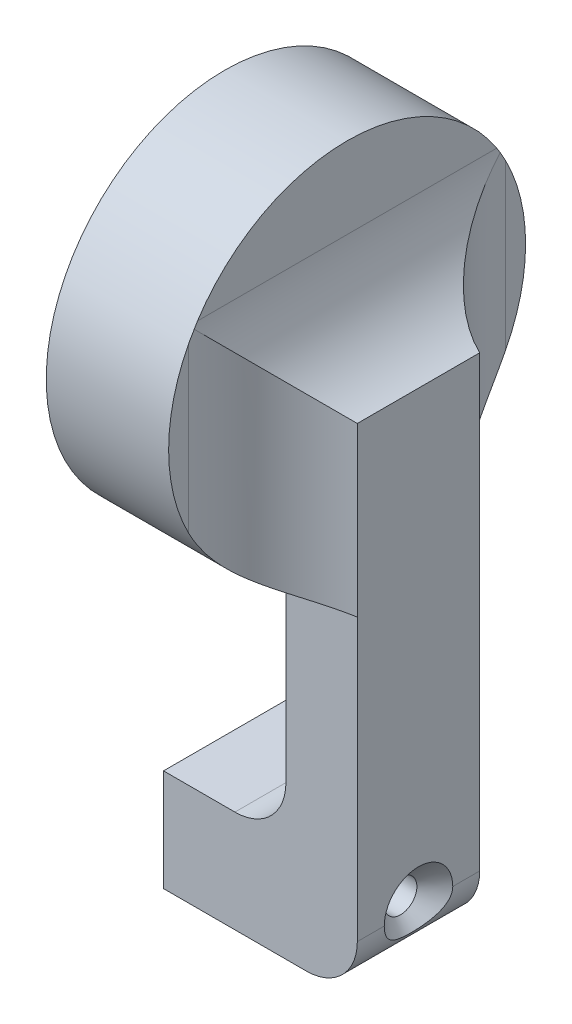
ISO-10303-21;
HEADER;
FILE_DESCRIPTION(('STEP AP214'),'2;1');
FILE_NAME('part.step','',(''),(''),'','','');
FILE_SCHEMA(('AUTOMOTIVE_DESIGN { 1 0 10303 214 1 1 1 1 }'));
ENDSEC;
DATA;
#1=APPLICATION_CONTEXT('core data for automotive mechanical design processes');
#2=APPLICATION_PROTOCOL_DEFINITION('international standard','automotive_design',2000,#1);
#3=PRODUCT_CONTEXT('',#1,'mechanical');
#4=PRODUCT('Part','Part','',(#3));
#5=PRODUCT_RELATED_PRODUCT_CATEGORY('part','',(#4));
#6=PRODUCT_DEFINITION_FORMATION('','',#4);
#7=PRODUCT_DEFINITION_CONTEXT('part definition',#1,'design');
#8=PRODUCT_DEFINITION('design','',#6,#7);
#9=PRODUCT_DEFINITION_SHAPE('','',#8);
#10=(LENGTH_UNIT() NAMED_UNIT(*) SI_UNIT(.MILLI.,.METRE.));
#11=(NAMED_UNIT(*) PLANE_ANGLE_UNIT() SI_UNIT($,.RADIAN.));
#12=(NAMED_UNIT(*) SI_UNIT($,.STERADIAN.) SOLID_ANGLE_UNIT());
#13=UNCERTAINTY_MEASURE_WITH_UNIT(LENGTH_MEASURE(1.E-05),#10,'distance_accuracy_value','');
#14=(GEOMETRIC_REPRESENTATION_CONTEXT(3) GLOBAL_UNCERTAINTY_ASSIGNED_CONTEXT((#13)) GLOBAL_UNIT_ASSIGNED_CONTEXT((#10,
#11,#12)) REPRESENTATION_CONTEXT('',''));
#15=CARTESIAN_POINT('',(0.,0.,0.));
#16=DIRECTION('',(0.,0.,1.));
#17=DIRECTION('',(1.,0.,0.));
#18=AXIS2_PLACEMENT_3D('',#15,#16,#17);
#19=CARTESIAN_POINT('',(-7.00000000000001,49.,6.));
#20=DIRECTION('',(-1.,0.,0.));
#21=DIRECTION('',(0.,-1.,0.));
#22=AXIS2_PLACEMENT_3D('',#19,#20,#21);
#23=PLANE('',#22);
#24=CARTESIAN_POINT('',(-7.00000000000001,49.,6.));
#25=DIRECTION('',(1.,0.,0.));
#26=DIRECTION('',(0.,1.,0.));
#27=AXIS2_PLACEMENT_3D('',#24,#25,#26);
#28=CIRCLE('',#27,17.5);
#29=CARTESIAN_POINT('',(-7.00000000000001,40.9515656286476,-9.53939201416945));
#30=VERTEX_POINT('',#29);
#31=CARTESIAN_POINT('',(-7.00000000000001,57.0484343713524,-9.53939201416945));
#32=VERTEX_POINT('',#31);
#33=EDGE_CURVE('E383',#30,#32,#28,.T.);
#34=ORIENTED_EDGE('',*,*,#33,.T.);
#35=DIRECTION('',(0.,-1.,0.));
#36=VECTOR('',#35,1.);
#37=CARTESIAN_POINT('',(-7.00000000000001,49.,-9.53939201416945));
#38=LINE('',#37,#36);
#39=EDGE_CURVE('E267',#32,#30,#38,.T.);
#40=ORIENTED_EDGE('',*,*,#39,.T.);
#41=EDGE_LOOP('',(#34,#40));
#42=FACE_BOUND('',#41,.T.);
#43=ADVANCED_FACE('F37',(#42),#23,.F.);
#44=CARTESIAN_POINT('',(-7.00000000000001,58.5393920141695,-8.67140075112121));
#45=VERTEX_POINT('',#44);
#46=CARTESIAN_POINT('',(-7.00000000000001,58.5393920141695,20.6714007511212));
#47=VERTEX_POINT('',#46);
#48=EDGE_CURVE('E259',#45,#47,#28,.T.);
#49=ORIENTED_EDGE('',*,*,#48,.T.);
#50=DIRECTION('',(0.,0.,-1.));
#51=VECTOR('',#50,1.);
#52=CARTESIAN_POINT('',(-7.00000000000001,58.5393920141695,6.));
#53=LINE('',#52,#51);
#54=EDGE_CURVE('E265',#47,#45,#53,.T.);
#55=ORIENTED_EDGE('',*,*,#54,.T.);
#56=EDGE_LOOP('',(#49,#55));
#57=FACE_BOUND('',#56,.T.);
#58=ADVANCED_FACE('F228',(#57),#23,.F.);
#59=CARTESIAN_POINT('',(-19.,10.,12.));
#60=DIRECTION('',(1.,0.,0.));
#61=DIRECTION('',(0.,0.,-1.));
#62=AXIS2_PLACEMENT_3D('',#59,#60,#61);
#63=PLANE('',#62);
#64=CARTESIAN_POINT('',(-19.,5.,6.));
#65=DIRECTION('',(1.,0.,0.));
#66=DIRECTION('',(0.,0.,-1.));
#67=AXIS2_PLACEMENT_3D('',#64,#65,#66);
#68=CIRCLE('',#67,1.6);
#69=CARTESIAN_POINT('',(-19.,5.,4.4));
#70=VERTEX_POINT('',#69);
#71=EDGE_CURVE('E187',#70,#70,#68,.T.);
#72=ORIENTED_EDGE('',*,*,#71,.T.);
#73=EDGE_LOOP('',(#72));
#74=FACE_BOUND('',#73,.T.);
#75=DIRECTION('',(0.,-1.,0.));
#76=VECTOR('',#75,1.);
#77=CARTESIAN_POINT('',(-19.,10.,0.));
#78=LINE('',#77,#76);
#79=CARTESIAN_POINT('',(-19.,10.,0.));
#80=VERTEX_POINT('',#79);
#81=CARTESIAN_POINT('',(-19.,0.,0.));
#82=VERTEX_POINT('',#81);
#83=EDGE_CURVE('E347',#80,#82,#78,.T.);
#84=ORIENTED_EDGE('',*,*,#83,.T.);
#85=DIRECTION('',(0.,0.,-1.));
#86=VECTOR('',#85,1.);
#87=CARTESIAN_POINT('',(-19.,0.,12.));
#88=LINE('',#87,#86);
#89=CARTESIAN_POINT('',(-19.,0.,12.));
#90=VERTEX_POINT('',#89);
#91=EDGE_CURVE('E363',#90,#82,#88,.T.);
#92=ORIENTED_EDGE('',*,*,#91,.F.);
#93=DIRECTION('',(0.,-1.,0.));
#94=VECTOR('',#93,1.);
#95=CARTESIAN_POINT('',(-19.,10.,12.));
#96=LINE('',#95,#94);
#97=CARTESIAN_POINT('',(-19.,10.,12.));
#98=VERTEX_POINT('',#97);
#99=EDGE_CURVE('E339',#98,#90,#96,.T.);
#100=ORIENTED_EDGE('',*,*,#99,.F.);
#101=DIRECTION('',(0.,0.,-1.));
#102=VECTOR('',#101,1.);
#103=CARTESIAN_POINT('',(-19.,10.,12.));
#104=LINE('',#103,#102);
#105=EDGE_CURVE('E346',#98,#80,#104,.T.);
#106=ORIENTED_EDGE('',*,*,#105,.T.);
#107=EDGE_LOOP('',(#84,#92,#100,#106));
#108=FACE_BOUND('',#107,.T.);
#109=ADVANCED_FACE('F225',(#74,#108),#63,.F.);
#110=CARTESIAN_POINT('',(-19.,0.,12.));
#111=DIRECTION('',(0.,1.,0.));
#112=DIRECTION('',(0.,0.,1.));
#113=AXIS2_PLACEMENT_3D('',#110,#111,#112);
#114=PLANE('',#113);
#115=DIRECTION('',(1.,0.,0.));
#116=VECTOR('',#115,1.);
#117=CARTESIAN_POINT('',(-19.,0.,0.));
#118=LINE('',#117,#116);
#119=CARTESIAN_POINT('',(-5.,0.,0.));
#120=VERTEX_POINT('',#119);
#121=EDGE_CURVE('E350',#82,#120,#118,.T.);
#122=ORIENTED_EDGE('',*,*,#121,.T.);
#123=DIRECTION('',(0.,0.,-1.));
#124=VECTOR('',#123,1.);
#125=CARTESIAN_POINT('',(-5.,0.,12.));
#126=LINE('',#125,#124);
#127=CARTESIAN_POINT('',(-5.,0.,12.));
#128=VERTEX_POINT('',#127);
#129=EDGE_CURVE('E173',#120,#128,#126,.F.);
#130=ORIENTED_EDGE('',*,*,#129,.T.);
#131=DIRECTION('',(1.,0.,0.));
#132=VECTOR('',#131,1.);
#133=CARTESIAN_POINT('',(-19.,0.,12.));
#134=LINE('',#133,#132);
#135=EDGE_CURVE('E335',#90,#128,#134,.T.);
#136=ORIENTED_EDGE('',*,*,#135,.F.);
#137=ORIENTED_EDGE('',*,*,#91,.T.);
#138=EDGE_LOOP('',(#122,#130,#136,#137));
#139=FACE_BOUND('',#138,.T.);
#140=ADVANCED_FACE('F222',(#139),#114,.F.);
#141=CARTESIAN_POINT('',(0.,0.,12.));
#142=DIRECTION('',(-1.,0.,0.));
#143=DIRECTION('',(0.,0.,1.));
#144=AXIS2_PLACEMENT_3D('',#141,#142,#143);
#145=PLANE('',#144);
#146=DIRECTION('',(0.,0.,-1.));
#147=VECTOR('',#146,1.);
#148=CARTESIAN_POINT('',(0.,5.,12.));
#149=LINE('',#148,#147);
#150=CARTESIAN_POINT('',(0.,5.,12.));
#151=VERTEX_POINT('',#150);
#152=CARTESIAN_POINT('',(0.,5.,9.36));
#153=VERTEX_POINT('',#152);
#154=EDGE_CURVE('E157',#151,#153,#149,.T.);
#155=ORIENTED_EDGE('',*,*,#154,.T.);
#156=CARTESIAN_POINT('',(0.,5.,6.));
#157=DIRECTION('',(1.,0.,0.));
#158=DIRECTION('',(0.,0.,-1.));
#159=AXIS2_PLACEMENT_3D('',#156,#157,#158);
#160=CIRCLE('',#159,3.36);
#161=CARTESIAN_POINT('',(0.,5.,2.64));
#162=VERTEX_POINT('',#161);
#163=EDGE_CURVE('E143',#162,#153,#160,.T.);
#164=ORIENTED_EDGE('',*,*,#163,.F.);
#165=CARTESIAN_POINT('',(0.,5.,0.));
#166=VERTEX_POINT('',#165);
#167=EDGE_CURVE('E154',#162,#166,#149,.T.);
#168=ORIENTED_EDGE('',*,*,#167,.T.);
#169=DIRECTION('',(0.,1.,0.));
#170=VECTOR('',#169,1.);
#171=CARTESIAN_POINT('',(0.,0.,0.));
#172=LINE('',#171,#170);
#173=CARTESIAN_POINT('',(0.,32.5607177772264,0.));
#174=VERTEX_POINT('',#173);
#175=EDGE_CURVE('E354',#166,#174,#172,.T.);
#176=ORIENTED_EDGE('',*,*,#175,.T.);
#177=CARTESIAN_POINT('',(0.,49.,0.));
#178=VERTEX_POINT('',#177);
#179=EDGE_CURVE('E353',#174,#178,#172,.T.);
#180=ORIENTED_EDGE('',*,*,#179,.T.);
#181=DIRECTION('',(0.,0.,-1.));
#182=VECTOR('',#181,1.);
#183=CARTESIAN_POINT('',(0.,49.,12.));
#184=LINE('',#183,#182);
#185=CARTESIAN_POINT('',(0.,49.,12.));
#186=VERTEX_POINT('',#185);
#187=EDGE_CURVE('E329',#186,#178,#184,.T.);
#188=ORIENTED_EDGE('',*,*,#187,.F.);
#189=DIRECTION('',(0.,1.,0.));
#190=VECTOR('',#189,1.);
#191=CARTESIAN_POINT('',(0.,0.,12.));
#192=LINE('',#191,#190);
#193=CARTESIAN_POINT('',(0.,32.5607177772264,12.));
#194=VERTEX_POINT('',#193);
#195=EDGE_CURVE('E332',#194,#186,#192,.T.);
#196=ORIENTED_EDGE('',*,*,#195,.F.);
#197=EDGE_CURVE('E334',#151,#194,#192,.T.);
#198=ORIENTED_EDGE('',*,*,#197,.F.);
#199=EDGE_LOOP('',(#155,#164,#168,#176,#180,#188,#196,#198));
#200=FACE_BOUND('',#199,.T.);
#201=ADVANCED_FACE('F152',(#200),#145,.F.);
#202=CARTESIAN_POINT('',(-7.,49.,12.));
#203=DIRECTION('',(1.,0.,0.));
#204=DIRECTION('',(0.,1.,0.));
#205=AXIS2_PLACEMENT_3D('',#202,#203,#204);
#206=PLANE('',#205);
#207=DIRECTION('',(0.,-1.,0.));
#208=VECTOR('',#207,1.);
#209=CARTESIAN_POINT('',(-7.,49.,12.));
#210=LINE('',#209,#208);
#211=CARTESIAN_POINT('',(-7.,32.5607177772264,12.));
#212=VERTEX_POINT('',#211);
#213=CARTESIAN_POINT('',(-7.,15.,12.));
#214=VERTEX_POINT('',#213);
#215=EDGE_CURVE('E337',#212,#214,#210,.T.);
#216=ORIENTED_EDGE('',*,*,#215,.F.);
#217=CARTESIAN_POINT('',(-7.,32.5607177772264,0.));
#218=VERTEX_POINT('',#217);
#219=EDGE_CURVE('E261',#212,#218,#28,.T.);
#220=ORIENTED_EDGE('',*,*,#219,.T.);
#221=DIRECTION('',(0.,-1.,0.));
#222=VECTOR('',#221,1.);
#223=CARTESIAN_POINT('',(-7.,49.,0.));
#224=LINE('',#223,#222);
#225=CARTESIAN_POINT('',(-7.,15.,0.));
#226=VERTEX_POINT('',#225);
#227=EDGE_CURVE('E356',#218,#226,#224,.T.);
#228=ORIENTED_EDGE('',*,*,#227,.T.);
#229=DIRECTION('',(0.,0.,-1.));
#230=VECTOR('',#229,1.);
#231=CARTESIAN_POINT('',(-7.,15.,12.));
#232=LINE('',#231,#230);
#233=EDGE_CURVE('E165',#226,#214,#232,.F.);
#234=ORIENTED_EDGE('',*,*,#233,.T.);
#235=EDGE_LOOP('',(#216,#220,#228,#234));
#236=FACE_BOUND('',#235,.T.);
#237=ADVANCED_FACE('F215',(#236),#206,.F.);
#238=CARTESIAN_POINT('',(-7.,10.,12.));
#239=DIRECTION('',(0.,-1.,0.));
#240=DIRECTION('',(1.,0.,0.));
#241=AXIS2_PLACEMENT_3D('',#238,#239,#240);
#242=PLANE('',#241);
#243=DIRECTION('',(-1.,0.,0.));
#244=VECTOR('',#243,1.);
#245=CARTESIAN_POINT('',(-7.,10.,12.));
#246=LINE('',#245,#244);
#247=CARTESIAN_POINT('',(-12.,10.,12.));
#248=VERTEX_POINT('',#247);
#249=EDGE_CURVE('E344',#248,#98,#246,.T.);
#250=ORIENTED_EDGE('',*,*,#249,.F.);
#251=DIRECTION('',(0.,0.,-1.));
#252=VECTOR('',#251,1.);
#253=CARTESIAN_POINT('',(-12.,10.,0.));
#254=LINE('',#253,#252);
#255=CARTESIAN_POINT('',(-12.,10.,0.));
#256=VERTEX_POINT('',#255);
#257=EDGE_CURVE('E168',#248,#256,#254,.T.);
#258=ORIENTED_EDGE('',*,*,#257,.T.);
#259=DIRECTION('',(-1.,0.,0.));
#260=VECTOR('',#259,1.);
#261=CARTESIAN_POINT('',(-7.,10.,0.));
#262=LINE('',#261,#260);
#263=EDGE_CURVE('E358',#256,#80,#262,.T.);
#264=ORIENTED_EDGE('',*,*,#263,.T.);
#265=ORIENTED_EDGE('',*,*,#105,.F.);
#266=EDGE_LOOP('',(#250,#258,#264,#265));
#267=FACE_BOUND('',#266,.T.);
#268=ADVANCED_FACE('F207',(#267),#242,.F.);
#269=CARTESIAN_POINT('',(0.,0.,12.));
#270=DIRECTION('',(0.,0.,1.));
#271=DIRECTION('',(1.,0.,0.));
#272=AXIS2_PLACEMENT_3D('',#269,#270,#271);
#273=PLANE('',#272);
#274=ORIENTED_EDGE('',*,*,#197,.T.);
#275=DIRECTION('',(1.,0.,0.));
#276=VECTOR('',#275,1.);
#277=CARTESIAN_POINT('',(0.,32.5607177772264,12.));
#278=LINE('',#277,#276);
#279=EDGE_CURVE('E274',#194,#212,#278,.F.);
#280=ORIENTED_EDGE('',*,*,#279,.T.);
#281=ORIENTED_EDGE('',*,*,#215,.T.);
#282=CARTESIAN_POINT('',(-12.,15.,12.));
#283=DIRECTION('',(0.,0.,1.));
#284=DIRECTION('',(1.,0.,0.));
#285=AXIS2_PLACEMENT_3D('',#282,#283,#284);
#286=CIRCLE('',#285,5.);
#287=EDGE_CURVE('E149',#214,#248,#286,.F.);
#288=ORIENTED_EDGE('',*,*,#287,.T.);
#289=ORIENTED_EDGE('',*,*,#249,.T.);
#290=ORIENTED_EDGE('',*,*,#99,.T.);
#291=ORIENTED_EDGE('',*,*,#135,.T.);
#292=CARTESIAN_POINT('',(-5.,5.,12.));
#293=DIRECTION('',(0.,0.,1.));
#294=DIRECTION('',(1.,0.,0.));
#295=AXIS2_PLACEMENT_3D('',#292,#293,#294);
#296=CIRCLE('',#295,5.);
#297=EDGE_CURVE('E175',#128,#151,#296,.T.);
#298=ORIENTED_EDGE('',*,*,#297,.T.);
#299=EDGE_LOOP('',(#274,#280,#281,#288,#289,#290,#291,#298));
#300=FACE_BOUND('',#299,.T.);
#301=ADVANCED_FACE('F203',(#300),#273,.T.);
#302=CARTESIAN_POINT('',(0.,0.,0.));
#303=DIRECTION('',(0.,0.,1.));
#304=DIRECTION('',(1.,0.,0.));
#305=AXIS2_PLACEMENT_3D('',#302,#303,#304);
#306=PLANE('',#305);
#307=ORIENTED_EDGE('',*,*,#227,.F.);
#308=DIRECTION('',(1.,0.,0.));
#309=VECTOR('',#308,1.);
#310=CARTESIAN_POINT('',(-7.,32.5607177772264,0.));
#311=LINE('',#310,#309);
#312=EDGE_CURVE('E55',#218,#174,#311,.T.);
#313=ORIENTED_EDGE('',*,*,#312,.T.);
#314=ORIENTED_EDGE('',*,*,#175,.F.);
#315=CARTESIAN_POINT('',(-5.,5.,0.));
#316=DIRECTION('',(0.,0.,1.));
#317=DIRECTION('',(1.,0.,0.));
#318=AXIS2_PLACEMENT_3D('',#315,#316,#317);
#319=CIRCLE('',#318,5.);
#320=EDGE_CURVE('E163',#166,#120,#319,.F.);
#321=ORIENTED_EDGE('',*,*,#320,.T.);
#322=ORIENTED_EDGE('',*,*,#121,.F.);
#323=ORIENTED_EDGE('',*,*,#83,.F.);
#324=ORIENTED_EDGE('',*,*,#263,.F.);
#325=CARTESIAN_POINT('',(-12.,15.,0.));
#326=DIRECTION('',(0.,0.,1.));
#327=DIRECTION('',(1.,0.,0.));
#328=AXIS2_PLACEMENT_3D('',#325,#326,#327);
#329=CIRCLE('',#328,5.);
#330=EDGE_CURVE('E177',#256,#226,#329,.T.);
#331=ORIENTED_EDGE('',*,*,#330,.T.);
#332=EDGE_LOOP('',(#307,#313,#314,#321,#322,#323,#324,#331));
#333=FACE_BOUND('',#332,.T.);
#334=ADVANCED_FACE('F206',(#333),#306,.F.);
#335=CARTESIAN_POINT('',(-12.,15.,12.));
#336=DIRECTION('',(0.,0.,1.));
#337=DIRECTION('',(1.,0.,0.));
#338=AXIS2_PLACEMENT_3D('',#335,#336,#337);
#339=CYLINDRICAL_SURFACE('',#338,5.);
#340=ORIENTED_EDGE('',*,*,#287,.F.);
#341=ORIENTED_EDGE('',*,*,#233,.F.);
#342=ORIENTED_EDGE('',*,*,#330,.F.);
#343=ORIENTED_EDGE('',*,*,#257,.F.);
#344=EDGE_LOOP('',(#340,#341,#342,#343));
#345=FACE_BOUND('',#344,.T.);
#346=ADVANCED_FACE('F211',(#345),#339,.F.);
#347=CARTESIAN_POINT('',(-5.,5.,12.));
#348=DIRECTION('',(0.,0.,-1.));
#349=DIRECTION('',(-1.,0.,0.));
#350=AXIS2_PLACEMENT_3D('',#347,#348,#349);
#351=CYLINDRICAL_SURFACE('',#350,5.);
#352=CARTESIAN_POINT('',(-0.011315848843505,5.3362,9.33176456314168));
#353=CARTESIAN_POINT('',(-0.00772757197950208,5.28307357224377,9.34073793852819));
#354=CARTESIAN_POINT('',(-0.00497945405434525,5.22953055867211,9.34759581175659));
#355=CARTESIAN_POINT('',(-0.00120169916334553,5.122015830721,9.35701294987783));
#356=CARTESIAN_POINT('',(-0.000171820449825417,5.06804417772279,9.35957281947863));
#357=CARTESIAN_POINT('',(0.000131472118228314,4.96036392501733,9.36032679135367));
#358=CARTESIAN_POINT('',(-0.000585306709140587,4.90665554543051,9.35854527012781));
#359=CARTESIAN_POINT('',(-0.00372939991401288,4.79961751433382,9.35071351486351));
#360=CARTESIAN_POINT('',(-0.00615666238439298,4.74628785138086,9.34466341036146));
#361=CARTESIAN_POINT('',(-0.0159253410549199,4.58744457367903,9.32024576365697));
#362=CARTESIAN_POINT('',(-0.0257535311398971,4.48297705955291,9.29561130648337));
#363=CARTESIAN_POINT('',(-0.0511079706715936,4.27955678578426,9.23125369367454));
#364=CARTESIAN_POINT('',(-0.0666408958163581,4.18061064416671,9.19151285859589));
#365=CARTESIAN_POINT('',(-0.10780065594994,3.95945787533021,9.08432067602215));
#366=CARTESIAN_POINT('',(-0.135066696296569,3.83987810638988,9.01207505041966));
#367=CARTESIAN_POINT('',(-0.194300629034804,3.61476062083223,8.84977809487663));
#368=CARTESIAN_POINT('',(-0.226278430223792,3.50925341201944,8.7596890995677));
#369=CARTESIAN_POINT('',(-0.302786340538611,3.28099515719922,8.53436772060684));
#370=CARTESIAN_POINT('',(-0.348043164870143,3.16362811449879,8.39393921956447));
#371=CARTESIAN_POINT('',(-0.436543082911837,2.95357013831708,8.09526862430747));
#372=CARTESIAN_POINT('',(-0.479784483712907,2.8608996517784,7.93701192290447));
#373=CARTESIAN_POINT('',(-0.560374395006792,2.69823900641181,7.60408338436946));
#374=CARTESIAN_POINT('',(-0.597599410954371,2.62869902347434,7.42916248661043));
#375=CARTESIAN_POINT('',(-0.660869935185352,2.51479587643307,7.06937216142148));
#376=CARTESIAN_POINT('',(-0.686920351739286,2.47042165589175,6.8845071420317));
#377=CARTESIAN_POINT('',(-0.71611583804456,2.42149152182494,6.59357275552867));
#378=CARTESIAN_POINT('',(-0.724293486961251,2.40800308672433,6.48941630585531));
#379=CARTESIAN_POINT('',(-0.735962021235243,2.38884748067089,6.28009529195409));
#380=CARTESIAN_POINT('',(-0.739452635648961,2.38318076186779,6.17493066980064));
#381=CARTESIAN_POINT('',(-0.741585846386518,2.37971176779502,5.96443622077509));
#382=CARTESIAN_POINT('',(-0.740228832692547,2.38190885989719,5.85910640787367));
#383=CARTESIAN_POINT('',(-0.732729668104386,2.39414978583919,5.64907937764492));
#384=CARTESIAN_POINT('',(-0.726587665424963,2.40419337663419,5.54438214082481));
#385=CARTESIAN_POINT('',(-0.71006240462118,2.43159920249629,5.33992933377131));
#386=CARTESIAN_POINT('',(-0.699830224721958,2.44870137904128,5.24012667212315));
#387=CARTESIAN_POINT('',(-0.67553629625392,2.4901033720404,5.0424887789204));
#388=CARTESIAN_POINT('',(-0.661473112784251,2.5144058856773,4.94465429932124));
#389=CARTESIAN_POINT('',(-0.614236269318479,2.59807498640754,4.6548734095481));
#390=CARTESIAN_POINT('',(-0.576020476960907,2.66819538143867,4.46670765982541));
#391=CARTESIAN_POINT('',(-0.489785843920782,2.83956766751821,4.09966973084193));
#392=CARTESIAN_POINT('',(-0.441483987169242,2.94177466091574,3.92131253643957));
#393=CARTESIAN_POINT('',(-0.342385466911368,3.17712524663109,3.58706097826518));
#394=CARTESIAN_POINT('',(-0.291594189785173,3.31020418581873,3.43112075846701));
#395=CARTESIAN_POINT('',(-0.212414903947883,3.55462385826613,3.20098665563638));
#396=CARTESIAN_POINT('',(-0.182506143715357,3.65674365246584,3.11749212386189));
#397=CARTESIAN_POINT('',(-0.127245129021495,3.87362483269717,2.96708657749484));
#398=CARTESIAN_POINT('',(-0.101884608722848,3.9883626618612,2.90014539367764));
#399=CARTESIAN_POINT('',(-0.0618979768052235,4.20907398221075,2.79626681787713));
#400=CARTESIAN_POINT('',(-0.0461911309715353,4.31336988931187,2.75620128418162));
#401=CARTESIAN_POINT('',(-0.0211960536863761,4.52766386730952,2.69291674577603));
#402=CARTESIAN_POINT('',(-0.0119003541714226,4.63765514273693,2.66967813853637));
#403=CARTESIAN_POINT('',(-0.00141620867842192,4.84625007948362,2.64351010935896));
#404=CARTESIAN_POINT('',(0.00065047606829209,4.94453009213531,2.63837987702755));
#405=CARTESIAN_POINT('',(-0.000598833898096579,5.09179752313453,2.6414908287441));
#406=CARTESIAN_POINT('',(-0.00174785726576853,5.14097425465424,2.64434799236461));
#407=CARTESIAN_POINT('',(-0.00547161679626646,5.23894331790461,2.65363104170702));
#408=CARTESIAN_POINT('',(-0.0080465636192309,5.28773559175654,2.66005745473573));
#409=CARTESIAN_POINT('',(-0.0113158488435046,5.3362,2.66823543685832));
#410=B_SPLINE_CURVE_WITH_KNOTS('',3,(#352,#353,#354,#355,#356,#357,#358,#359,#360,#361,#362,
#363,#364,#365,#366,#367,#368,#369,#370,#371,#372,#373,#374,#375,#376,#377,#378,#379,#380,#381,
#382,#383,#384,#385,#386,#387,#388,#389,#390,#391,#392,#393,#394,#395,#396,#397,#398,#399,#400,
#401,#402,#403,#404,#405,#406,#407,#408,#409),.UNSPECIFIED.,.F.,.F.,(4,2,2,2,2,2,2,2,2,2,2,2,2,
2,2,2,2,2,2,2,2,2,2,2,2,2,2,2,4),(0.,0.161949153878159,0.323875520396958,0.484894782646261,
0.645909158741388,0.967642960373945,1.28975446174662,1.71444230487352,2.14003635901215,
2.70264743268856,3.26572287019871,3.8391909020768,4.41240678839821,4.72809639262478,
5.04380424514692,5.35948670016251,5.67515937732044,5.98011440360915,6.28518380810048,
6.89549708316569,7.52604570336867,8.15528554065106,8.55970909363579,8.96339004202785,
9.30046415482828,9.63714495857486,9.93115234719074,10.0788375168095,10.2265445106583),.UNSPECIFIED.);
#411=EDGE_CURVE('E139',#153,#162,#410,.T.);
#412=ORIENTED_EDGE('',*,*,#411,.F.);
#413=ORIENTED_EDGE('',*,*,#154,.F.);
#414=ORIENTED_EDGE('',*,*,#297,.F.);
#415=ORIENTED_EDGE('',*,*,#129,.F.);
#416=ORIENTED_EDGE('',*,*,#320,.F.);
#417=ORIENTED_EDGE('',*,*,#167,.F.);
#418=EDGE_LOOP('',(#412,#413,#414,#415,#416,#417));
#419=FACE_BOUND('',#418,.T.);
#420=ADVANCED_FACE('F161',(#419),#351,.T.);
#421=CARTESIAN_POINT('',(0.,5.,6.));
#422=DIRECTION('',(1.,0.,0.));
#423=DIRECTION('',(0.,0.,-1.));
#424=AXIS2_PLACEMENT_3D('',#421,#422,#423);
#425=CYLINDRICAL_SURFACE('',#424,1.6);
#426=CARTESIAN_POINT('',(-1.76,5.,6.));
#427=DIRECTION('',(1.,0.,0.));
#428=DIRECTION('',(0.,0.,-1.));
#429=AXIS2_PLACEMENT_3D('',#426,#427,#428);
#430=CIRCLE('',#429,1.6);
#431=CARTESIAN_POINT('',(-1.76,5.,4.4));
#432=VERTEX_POINT('',#431);
#433=EDGE_CURVE('E158',#432,#432,#430,.T.);
#434=ORIENTED_EDGE('',*,*,#433,.T.);
#435=EDGE_LOOP('',(#434));
#436=FACE_BOUND('',#435,.T.);
#437=ORIENTED_EDGE('',*,*,#71,.F.);
#438=EDGE_LOOP('',(#437));
#439=FACE_BOUND('',#438,.T.);
#440=ADVANCED_FACE('F197',(#436,#439),#425,.F.);
#441=CARTESIAN_POINT('',(0.,5.,6.));
#442=DIRECTION('',(1.,0.,0.));
#443=DIRECTION('',(0.,0.,-1.));
#444=AXIS2_PLACEMENT_3D('',#441,#442,#443);
#445=CONICAL_SURFACE('',#444,3.36,0.785398163397449);
#446=ORIENTED_EDGE('',*,*,#411,.T.);
#447=ORIENTED_EDGE('',*,*,#163,.T.);
#448=EDGE_LOOP('',(#446,#447));
#449=FACE_BOUND('',#448,.T.);
#450=ORIENTED_EDGE('',*,*,#433,.F.);
#451=EDGE_LOOP('',(#450));
#452=FACE_BOUND('',#451,.T.);
#453=ADVANCED_FACE('F141',(#449,#452),#445,.F.);
#454=CARTESIAN_POINT('',(-7.00000000000001,57.0484343713524,21.5393920141695));
#455=VERTEX_POINT('',#454);
#456=CARTESIAN_POINT('',(-7.00000000000001,40.9515656286476,21.5393920141695));
#457=VERTEX_POINT('',#456);
#458=EDGE_CURVE('E256',#455,#457,#28,.T.);
#459=ORIENTED_EDGE('',*,*,#458,.T.);
#460=DIRECTION('',(0.,-1.,0.));
#461=VECTOR('',#460,1.);
#462=CARTESIAN_POINT('',(-7.00000000000001,49.,21.5393920141695));
#463=LINE('',#462,#461);
#464=EDGE_CURVE('E258',#457,#455,#463,.F.);
#465=ORIENTED_EDGE('',*,*,#464,.T.);
#466=EDGE_LOOP('',(#459,#465));
#467=FACE_BOUND('',#466,.T.);
#468=ADVANCED_FACE('F196',(#467),#23,.F.);
#469=CARTESIAN_POINT('',(-19.,49.,6.));
#470=DIRECTION('',(1.,0.,0.));
#471=DIRECTION('',(0.,1.,0.));
#472=AXIS2_PLACEMENT_3D('',#469,#470,#471);
#473=CYLINDRICAL_SURFACE('',#472,17.5);
#474=CARTESIAN_POINT('',(-19.,49.,6.));
#475=DIRECTION('',(1.,0.,0.));
#476=DIRECTION('',(0.,1.,0.));
#477=AXIS2_PLACEMENT_3D('',#474,#475,#476);
#478=CIRCLE('',#477,17.5);
#479=CARTESIAN_POINT('',(-19.,66.5,6.));
#480=VERTEX_POINT('',#479);
#481=EDGE_CURVE('E380',#480,#480,#478,.T.);
#482=ORIENTED_EDGE('',*,*,#481,.T.);
#483=EDGE_LOOP('',(#482));
#484=FACE_BOUND('',#483,.T.);
#485=ORIENTED_EDGE('',*,*,#219,.F.);
#486=ORIENTED_EDGE('',*,*,#279,.F.);
#487=CARTESIAN_POINT('',(0.,32.5607177772264,12.));
#488=CARTESIAN_POINT('',(-0.246734921967885,32.5890512016674,12.0775477819252));
#489=CARTESIAN_POINT('',(-0.490019939164099,32.6214232422671,12.1646202670033));
#490=CARTESIAN_POINT('',(-0.968016300483111,32.6950128863617,12.356747577533));
#491=CARTESIAN_POINT('',(-1.20272711724859,32.7362310328691,12.4618035068067));
#492=CARTESIAN_POINT('',(-1.66160032047372,32.8282237639029,12.6886872667715));
#493=CARTESIAN_POINT('',(-1.88577479611073,32.8789870445342,12.8104952133956));
#494=CARTESIAN_POINT('',(-2.32226754359946,32.9909064588336,13.0695716653056));
#495=CARTESIAN_POINT('',(-2.5345865244743,33.0520619701034,13.2068392445369));
#496=CARTESIAN_POINT('',(-2.94622582823166,33.1856346226321,13.4954082797616));
#497=CARTESIAN_POINT('',(-3.14552628574305,33.258068429081,13.6467303674712));
#498=CARTESIAN_POINT('',(-3.52949941009916,33.4148045328936,13.9613160051885));
#499=CARTESIAN_POINT('',(-3.71417204755731,33.4991068540996,14.1245795791848));
#500=CARTESIAN_POINT('',(-4.06772403378775,33.6800262837891,14.4607804081323));
#501=CARTESIAN_POINT('',(-4.23661510810767,33.7766341212224,14.6337103259207));
#502=CARTESIAN_POINT('',(-4.55803674724348,33.9825219548839,14.9870546624675));
#503=CARTESIAN_POINT('',(-4.7105674488638,34.0918018451332,15.167469018624));
#504=CARTESIAN_POINT('',(-4.99784162084205,34.322263735714,15.5320627180293));
#505=CARTESIAN_POINT('',(-5.1327071678566,34.4433527162461,15.7162048151436));
#506=CARTESIAN_POINT('',(-5.38594504288162,34.6979384642728,16.0872020956498));
#507=CARTESIAN_POINT('',(-5.50431773053201,34.8314349611058,16.2740572197838));
#508=CARTESIAN_POINT('',(-5.72496427356558,35.1105435343169,16.6483572979077));
#509=CARTESIAN_POINT('',(-5.82723108741056,35.25616086767,16.8358024735416));
#510=CARTESIAN_POINT('',(-6.01627148245155,35.5589468060278,17.2091885499114));
#511=CARTESIAN_POINT('',(-6.10304216566345,35.7161175639357,17.3951291630796));
#512=CARTESIAN_POINT('',(-6.28740646012158,36.0934034937673,17.8226428045446));
#513=CARTESIAN_POINT('',(-6.37958568925982,36.317572988188,18.062988655251));
#514=CARTESIAN_POINT('',(-6.54107832152276,36.7832618876982,18.5344009662844));
#515=CARTESIAN_POINT('',(-6.61038401721757,37.0247871076311,18.7654642757939));
#516=CARTESIAN_POINT('',(-6.72914426919601,37.5239144514408,19.2160022318398));
#517=CARTESIAN_POINT('',(-6.77855803945896,37.7815483680249,19.4354522751179));
#518=CARTESIAN_POINT('',(-6.8603676885811,38.3106665021776,19.8601325451385));
#519=CARTESIAN_POINT('',(-6.89276748991752,38.5821475115264,20.0653660399485));
#520=CARTESIAN_POINT('',(-6.94869206010633,39.1932685636771,20.4998374127527));
#521=CARTESIAN_POINT('',(-6.9691307863213,39.5356532143771,20.7256267483871));
#522=CARTESIAN_POINT('',(-6.98835417842826,40.0596798083615,21.0453418341763));
#523=CARTESIAN_POINT('',(-6.99285937082227,40.2355964529391,21.1484928772201));
#524=CARTESIAN_POINT('',(-6.99868009507586,40.5909778734871,21.3486127335081));
#525=CARTESIAN_POINT('',(-6.99999545127619,40.7704428443095,21.4455812060016));
#526=CARTESIAN_POINT('',(-7.,40.9515656286476,21.5393920141695));
#527=B_SPLINE_CURVE_WITH_KNOTS('',3,(#487,#488,#489,#490,#491,#492,#493,#494,#495,#496,#497,
#498,#499,#500,#501,#502,#503,#504,#505,#506,#507,#508,#509,#510,#511,#512,#513,#514,#515,#516,
#517,#518,#519,#520,#521,#522,#523,#524,#525,#526),.UNSPECIFIED.,.F.,.F.,(4,2,2,2,2,2,2,2,2,2,2,
2,2,2,2,2,2,2,2,4),(0.,0.780331581163982,1.5607110761946,2.34017215616797,3.11958657008673,
3.90016379814275,4.68074259429933,5.46073673814751,6.24072435922315,7.01500010970227,
7.78925897383998,8.56385541222162,9.33859655916867,10.3611231560983,11.383993951045,
12.4089514671219,13.4336725810076,14.6640432210063,15.2758558482986,15.887702166382),.UNSPECIFIED.);
#528=EDGE_CURVE('E47',#194,#457,#527,.T.);
#529=ORIENTED_EDGE('',*,*,#528,.T.);
#530=ORIENTED_EDGE('',*,*,#458,.F.);
#531=CARTESIAN_POINT('',(-7.00000000000001,57.0484343713524,21.5393920141695));
#532=CARTESIAN_POINT('',(-6.99999981741292,57.1295544041186,21.4973770164674));
#533=CARTESIAN_POINT('',(-6.99973520937693,57.2103456258225,21.4547264939439));
#534=CARTESIAN_POINT('',(-6.99862788984655,57.3712236581746,21.3681799245172));
#535=CARTESIAN_POINT('',(-6.99778534737232,57.4513106678397,21.3242842453641));
#536=CARTESIAN_POINT('',(-6.99547296186159,57.6107810908042,21.2352482252026));
#537=CARTESIAN_POINT('',(-6.99400311765536,57.6901645027912,21.1901078818734));
#538=CARTESIAN_POINT('',(-6.99038463769568,57.8482265605254,21.0985837193089));
#539=CARTESIAN_POINT('',(-6.9882358035758,57.9269049933969,21.0521995403166));
#540=CARTESIAN_POINT('',(-6.98572213653554,58.005207203543,21.005207203543));
#541=B_SPLINE_CURVE_WITH_KNOTS('',3,(#531,#532,#533,#534,#535,#536,#537,#538,#539,#540),
.UNSPECIFIED.,.F.,.F.,(4,2,2,2,4),(0.,0.27406200027668,0.548043883749916,0.822026278119452,
1.09608879037297),.UNSPECIFIED.);
#542=CARTESIAN_POINT('',(-6.98572213653555,58.005207203543,21.005207203543));
#543=VERTEX_POINT('',#542);
#544=EDGE_CURVE('E11',#455,#543,#541,.T.);
#545=ORIENTED_EDGE('',*,*,#544,.T.);
#546=CARTESIAN_POINT('',(-6.98572213653555,58.005207203543,21.005207203543));
#547=CARTESIAN_POINT('',(-6.99050814935266,58.095193098607,20.9512041417609));
#548=CARTESIAN_POINT('',(-6.99409097771658,58.1847014470224,20.8963854065027));
#549=CARTESIAN_POINT('',(-6.9988502655383,58.3627630505646,20.785116589029));
#550=CARTESIAN_POINT('',(-7.00002672499586,58.4513163056914,20.7286665068132));
#551=CARTESIAN_POINT('',(-7.00000000000001,58.5393920141695,20.6714007511212));
#552=B_SPLINE_CURVE_WITH_KNOTS('',3,(#546,#547,#548,#549,#550,#551),.UNSPECIFIED.,.F.,.F.,(4,2,
4),(0.,0.315066776214181,0.63013355245865),.UNSPECIFIED.);
#553=EDGE_CURVE('E304',#543,#47,#552,.T.);
#554=ORIENTED_EDGE('',*,*,#553,.T.);
#555=ORIENTED_EDGE('',*,*,#48,.F.);
#556=CARTESIAN_POINT('',(-7.00000000000001,58.5393920141695,-8.67140075112121));
#557=CARTESIAN_POINT('',(-7.00002672499586,58.4513163056914,-8.72866650681319));
#558=CARTESIAN_POINT('',(-6.9988502655383,58.3627630505646,-8.78511658902895));
#559=CARTESIAN_POINT('',(-6.99409097771658,58.1847014470224,-8.89638540650272));
#560=CARTESIAN_POINT('',(-6.99050814935266,58.095193098607,-8.95120414176087));
#561=CARTESIAN_POINT('',(-6.98572213653555,58.005207203543,-9.00520720354297));
#562=B_SPLINE_CURVE_WITH_KNOTS('',3,(#556,#557,#558,#559,#560,#561),.UNSPECIFIED.,.F.,.F.,(4,2,
4),(0.,0.31506677624447,0.630133552458651),.UNSPECIFIED.);
#563=CARTESIAN_POINT('',(-6.98572213653555,58.005207203543,-9.00520720354297));
#564=VERTEX_POINT('',#563);
#565=EDGE_CURVE('E298',#45,#564,#562,.T.);
#566=ORIENTED_EDGE('',*,*,#565,.T.);
#567=CARTESIAN_POINT('',(-6.98572213653555,58.005207203543,-9.00520720354297));
#568=CARTESIAN_POINT('',(-6.9882358035758,57.9269049933969,-9.05219954031659));
#569=CARTESIAN_POINT('',(-6.99038463769568,57.8482265605254,-9.09858371930894));
#570=CARTESIAN_POINT('',(-6.99400311765536,57.6901645027912,-9.19010788187338));
#571=CARTESIAN_POINT('',(-6.99547296186159,57.6107810908042,-9.23524822520255));
#572=CARTESIAN_POINT('',(-6.99778534737232,57.4513106678397,-9.32428424536409));
#573=CARTESIAN_POINT('',(-6.99862788984655,57.3712236581746,-9.36817992451724));
#574=CARTESIAN_POINT('',(-6.99973520937692,57.2103456258225,-9.45472649394393));
#575=CARTESIAN_POINT('',(-6.99999981741292,57.1295544041186,-9.49737701646736));
#576=CARTESIAN_POINT('',(-7.,57.0484343713524,-9.53939201416946));
#577=B_SPLINE_CURVE_WITH_KNOTS('',3,(#567,#568,#569,#570,#571,#572,#573,#574,#575,#576),
.UNSPECIFIED.,.F.,.F.,(4,2,2,2,4),(0.,0.27406251225351,0.548044906623053,0.822026790096289,
1.09608879037297),.UNSPECIFIED.);
#578=EDGE_CURVE('E282',#564,#32,#577,.T.);
#579=ORIENTED_EDGE('',*,*,#578,.T.);
#580=ORIENTED_EDGE('',*,*,#33,.F.);
#581=CARTESIAN_POINT('',(-7.00000000000001,40.9515656286476,-9.53939201416945));
#582=CARTESIAN_POINT('',(-6.99999478450813,40.7639301003624,-9.44220857529644));
#583=CARTESIAN_POINT('',(-6.99858345709887,40.5780713535877,-9.34163398402168));
#584=CARTESIAN_POINT('',(-6.99231466031733,40.2101314313799,-9.13383215901959));
#585=CARTESIAN_POINT('',(-6.9874566182482,40.0280508888985,-9.02660382242612));
#586=CARTESIAN_POINT('',(-6.966733662337,39.4871717446182,-8.69473276588707));
#587=CARTESIAN_POINT('',(-6.94471473953177,39.13450247543,-8.46030122480416));
#588=CARTESIAN_POINT('',(-6.87855579694855,38.445656983911,-7.9655694611302));
#589=CARTESIAN_POINT('',(-6.83424080595989,38.1096346787901,-7.70507789064675));
#590=CARTESIAN_POINT('',(-6.7175131346636,37.4604925373586,-7.16313395282449));
#591=CARTESIAN_POINT('',(-6.64513162337925,37.1473477514822,-6.88170511638508));
#592=CARTESIAN_POINT('',(-6.49470662326901,36.641990500039,-6.39399614338271));
#593=CARTESIAN_POINT('',(-6.42568432266299,36.4428392098329,-6.19207991844346));
#594=CARTESIAN_POINT('',(-6.27003194618994,36.0577269139105,-5.78246641709438));
#595=CARTESIAN_POINT('',(-6.18340234447794,35.8717655531784,-5.57476929649089));
#596=CARTESIAN_POINT('',(-5.9914135999126,35.5147800310488,-5.15679565534921));
#597=CARTESIAN_POINT('',(-5.88613023247824,35.3436994626082,-4.94653266023544));
#598=CARTESIAN_POINT('',(-5.65546140581323,35.0165054054542,-4.52534953639522));
#599=CARTESIAN_POINT('',(-5.53007627646286,34.8603916711945,-4.31442941850817));
#600=CARTESIAN_POINT('',(-5.25745797510624,34.5625970544902,-3.89335202069169));
#601=CARTESIAN_POINT('',(-5.11006230144009,34.4210380049301,-3.68321346532827));
#602=CARTESIAN_POINT('',(-4.79400266002995,34.1540652066545,-3.26871121261543));
#603=CARTESIAN_POINT('',(-4.62533801434993,34.028651972835,-3.06434769959638));
#604=CARTESIAN_POINT('',(-4.26696082572713,33.7937711336738,-2.66455110945795));
#605=CARTESIAN_POINT('',(-4.07722147076872,33.6843242602511,-2.46912986556919));
#606=CARTESIAN_POINT('',(-3.67790255481096,33.4811483305989,-2.09081939381212));
#607=CARTESIAN_POINT('',(-3.46832547769885,33.3874173106448,-1.90792860193235));
#608=CARTESIAN_POINT('',(-3.05350728609828,33.2238372001434,-1.57583898762791));
#609=CARTESIAN_POINT('',(-2.85006265675395,33.1525203753322,-1.4251122412209));
#610=CARTESIAN_POINT('',(-2.42979777757675,33.0211790062004,-1.13808071129761));
#611=CARTESIAN_POINT('',(-2.2129781077103,32.9611539727033,-1.00177530314041));
#612=CARTESIAN_POINT('',(-1.76791768509573,32.8516927221853,-0.745484865039353));
#613=CARTESIAN_POINT('',(-1.53969828660961,32.8022375600356,-0.625470778356171));
#614=CARTESIAN_POINT('',(-1.07321180483003,32.7129688335855,-0.402889991575208));
#615=CARTESIAN_POINT('',(-0.834950370023787,32.6731499318264,-0.300313642246034));
#616=CARTESIAN_POINT('',(-0.495010368305857,32.6235073257173,-0.16944817651438));
#617=CARTESIAN_POINT('',(-0.396790512388885,32.609977818292,-0.133394842155126));
#618=CARTESIAN_POINT('',(-0.199237523998654,32.5843179761978,-0.064382481562141));
#619=CARTESIAN_POINT('',(-0.0999060429783667,32.5721858074836,-0.0314194101007535));
#620=CARTESIAN_POINT('',(0.,32.5607177772264,0.));
#621=B_SPLINE_CURVE_WITH_KNOTS('',3,(#581,#582,#583,#584,#585,#586,#587,#588,#589,#590,#591,
#592,#593,#594,#595,#596,#597,#598,#599,#600,#601,#602,#603,#604,#605,#606,#607,#608,#609,#610,
#611,#612,#613,#614,#615,#616,#617,#618,#619,#620),.UNSPECIFIED.,.F.,.F.,(4,2,2,2,2,2,2,2,2,2,2,
2,2,2,2,2,2,2,2,4),(0.,0.633847733744758,1.26780081059685,2.53829030817665,3.81890938463906,
5.09811033545955,5.97297741713359,6.84782094223431,7.71918891552301,8.59054259067745,
9.46868035714072,10.3468461208092,11.2261422006592,12.1053283288492,12.8935138466811,
13.6816652113269,14.468391844331,15.2546817123201,15.5711307266188,15.8871595420537),.UNSPECIFIED.);
#622=EDGE_CURVE('E276',#30,#174,#621,.T.);
#623=ORIENTED_EDGE('',*,*,#622,.T.);
#624=ORIENTED_EDGE('',*,*,#312,.F.);
#625=EDGE_LOOP('',(#485,#486,#529,#530,#545,#554,#555,#566,#579,#580,#623,#624));
#626=FACE_BOUND('',#625,.T.);
#627=ADVANCED_FACE('F247',(#484,#626),#473,.T.);
#628=CARTESIAN_POINT('',(-19.,49.,6.));
#629=DIRECTION('',(1.,0.,0.));
#630=DIRECTION('',(0.,1.,0.));
#631=AXIS2_PLACEMENT_3D('',#628,#629,#630);
#632=PLANE('',#631);
#633=CARTESIAN_POINT('',(-19.,49.,6.));
#634=DIRECTION('',(1.,0.,0.));
#635=DIRECTION('',(0.,1.,0.));
#636=AXIS2_PLACEMENT_3D('',#633,#634,#635);
#637=CIRCLE('',#636,9.);
#638=CARTESIAN_POINT('',(-19.,58.,6.));
#639=VERTEX_POINT('',#638);
#640=EDGE_CURVE('E148',#639,#639,#637,.T.);
#641=ORIENTED_EDGE('',*,*,#640,.T.);
#642=EDGE_LOOP('',(#641));
#643=FACE_BOUND('',#642,.T.);
#644=ORIENTED_EDGE('',*,*,#481,.F.);
#645=EDGE_LOOP('',(#644));
#646=FACE_BOUND('',#645,.T.);
#647=ADVANCED_FACE('F252',(#643,#646),#632,.F.);
#648=CARTESIAN_POINT('',(-25.,49.,6.));
#649=DIRECTION('',(-1.,0.,0.));
#650=DIRECTION('',(0.,-1.,0.));
#651=AXIS2_PLACEMENT_3D('',#648,#649,#650);
#652=PLANE('',#651);
#653=CARTESIAN_POINT('',(-25.,49.,6.));
#654=DIRECTION('',(-1.,0.,0.));
#655=DIRECTION('',(0.,-1.,0.));
#656=AXIS2_PLACEMENT_3D('',#653,#654,#655);
#657=CIRCLE('',#656,9.);
#658=CARTESIAN_POINT('',(-25.,40.,6.));
#659=VERTEX_POINT('',#658);
#660=EDGE_CURVE('E159',#659,#659,#657,.T.);
#661=ORIENTED_EDGE('',*,*,#660,.T.);
#662=EDGE_LOOP('',(#661));
#663=FACE_BOUND('',#662,.T.);
#664=ADVANCED_FACE('F292',(#663),#652,.T.);
#665=CARTESIAN_POINT('',(-25.,49.,6.));
#666=DIRECTION('',(1.,0.,0.));
#667=DIRECTION('',(0.,1.,0.));
#668=AXIS2_PLACEMENT_3D('',#665,#666,#667);
#669=CYLINDRICAL_SURFACE('',#668,9.);
#670=ORIENTED_EDGE('',*,*,#660,.F.);
#671=EDGE_LOOP('',(#670));
#672=FACE_BOUND('',#671,.T.);
#673=ORIENTED_EDGE('',*,*,#640,.F.);
#674=EDGE_LOOP('',(#673));
#675=FACE_BOUND('',#674,.T.);
#676=ADVANCED_FACE('F198',(#672,#675),#669,.T.);
#677=CARTESIAN_POINT('',(3.,0.,21.5393920141695));
#678=DIRECTION('',(0.,-1.,0.));
#679=DIRECTION('',(0.,0.,-1.));
#680=AXIS2_PLACEMENT_3D('',#677,#678,#679);
#681=CYLINDRICAL_SURFACE('',#680,10.);
#682=ORIENTED_EDGE('',*,*,#528,.F.);
#683=ORIENTED_EDGE('',*,*,#195,.T.);
#684=CARTESIAN_POINT('',(3.,58.5393920141695,21.5393920141695));
#685=DIRECTION('',(0.,0.707106781186547,-0.707106781186547));
#686=DIRECTION('',(0.,-0.707106781186547,-0.707106781186547));
#687=AXIS2_PLACEMENT_3D('',#684,#685,#686);
#688=ELLIPSE('',#687,14.1421356237309,10.);
#689=EDGE_CURVE('E42',#543,#186,#688,.F.);
#690=ORIENTED_EDGE('',*,*,#689,.F.);
#691=ORIENTED_EDGE('',*,*,#544,.F.);
#692=ORIENTED_EDGE('',*,*,#464,.F.);
#693=EDGE_LOOP('',(#682,#683,#690,#691,#692));
#694=FACE_BOUND('',#693,.T.);
#695=ADVANCED_FACE('F39',(#694),#681,.F.);
#696=CARTESIAN_POINT('',(2.99999999999999,58.5393920141695,12.));
#697=DIRECTION('',(0.,0.,-1.));
#698=DIRECTION('',(-1.,0.,0.));
#699=AXIS2_PLACEMENT_3D('',#696,#697,#698);
#700=CYLINDRICAL_SURFACE('',#699,10.);
#701=ORIENTED_EDGE('',*,*,#689,.T.);
#702=ORIENTED_EDGE('',*,*,#187,.T.);
#703=CARTESIAN_POINT('',(3.,58.5393920141695,-9.53939201416945));
#704=DIRECTION('',(0.,-0.707106781186547,-0.707106781186547));
#705=DIRECTION('',(0.,-0.707106781186547,0.707106781186547));
#706=AXIS2_PLACEMENT_3D('',#703,#704,#705);
#707=ELLIPSE('',#706,14.1421356237309,10.);
#708=EDGE_CURVE('E318',#564,#178,#707,.F.);
#709=ORIENTED_EDGE('',*,*,#708,.F.);
#710=ORIENTED_EDGE('',*,*,#565,.F.);
#711=ORIENTED_EDGE('',*,*,#54,.F.);
#712=ORIENTED_EDGE('',*,*,#553,.F.);
#713=EDGE_LOOP('',(#701,#702,#709,#710,#711,#712));
#714=FACE_BOUND('',#713,.T.);
#715=ADVANCED_FACE('F328',(#714),#700,.F.);
#716=CARTESIAN_POINT('',(3.,0.,-9.53939201416945));
#717=DIRECTION('',(0.,-1.,0.));
#718=DIRECTION('',(0.,0.,-1.));
#719=AXIS2_PLACEMENT_3D('',#716,#717,#718);
#720=CYLINDRICAL_SURFACE('',#719,10.);
#721=ORIENTED_EDGE('',*,*,#708,.T.);
#722=ORIENTED_EDGE('',*,*,#179,.F.);
#723=ORIENTED_EDGE('',*,*,#622,.F.);
#724=ORIENTED_EDGE('',*,*,#39,.F.);
#725=ORIENTED_EDGE('',*,*,#578,.F.);
#726=EDGE_LOOP('',(#721,#722,#723,#724,#725));
#727=FACE_BOUND('',#726,.T.);
#728=ADVANCED_FACE('F288',(#727),#720,.F.);
#729=CLOSED_SHELL('',(#43,#58,#109,#140,#201,#237,#268,#301,#334,#346,#420,#440,#453,#468,#627,
#647,#664,#676,#695,#715,#728));
#730=MANIFOLD_SOLID_BREP('B2',#729);
#731=ADVANCED_BREP_SHAPE_REPRESENTATION('',(#18,#730),#14);
#732=SHAPE_DEFINITION_REPRESENTATION(#9,#731);
ENDSEC;
END-ISO-10303-21;
